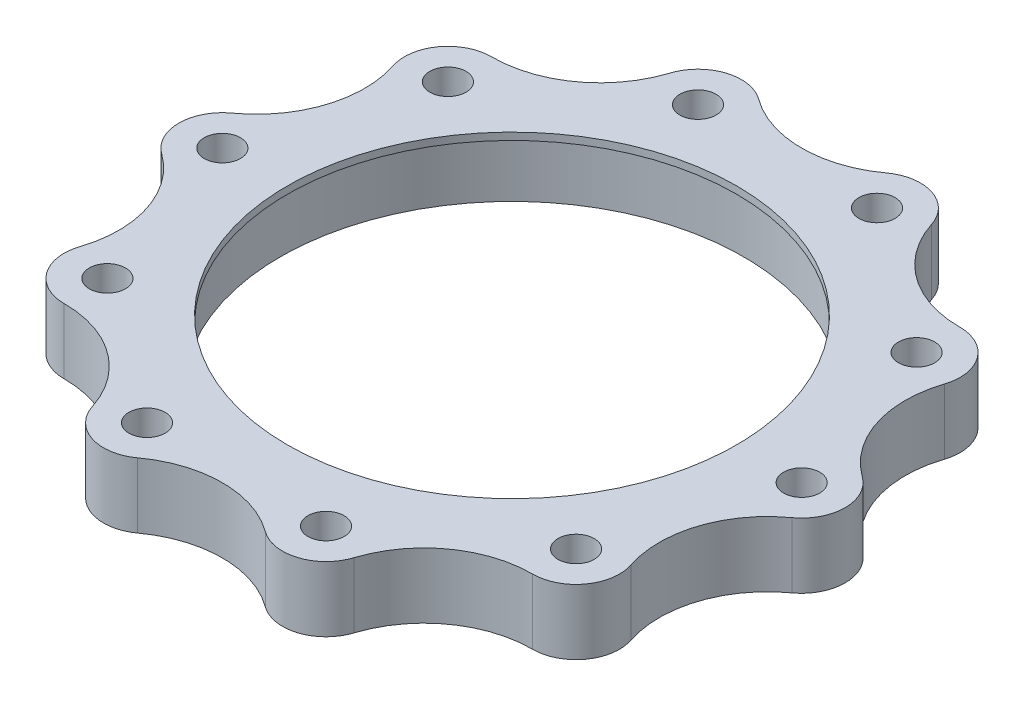
ISO-10303-21;
HEADER;
FILE_DESCRIPTION(('STEP AP214'),'2;1');
FILE_NAME('part.step','',(''),(''),'','','');
FILE_SCHEMA(('AUTOMOTIVE_DESIGN { 1 0 10303 214 1 1 1 1 }'));
ENDSEC;
DATA;
#1=APPLICATION_CONTEXT('core data for automotive mechanical design processes');
#2=APPLICATION_PROTOCOL_DEFINITION('international standard','automotive_design',2000,#1);
#3=PRODUCT_CONTEXT('',#1,'mechanical');
#4=PRODUCT('Part','Part','',(#3));
#5=PRODUCT_RELATED_PRODUCT_CATEGORY('part','',(#4));
#6=PRODUCT_DEFINITION_FORMATION('','',#4);
#7=PRODUCT_DEFINITION_CONTEXT('part definition',#1,'design');
#8=PRODUCT_DEFINITION('design','',#6,#7);
#9=PRODUCT_DEFINITION_SHAPE('','',#8);
#10=(LENGTH_UNIT() NAMED_UNIT(*) SI_UNIT(.MILLI.,.METRE.));
#11=(NAMED_UNIT(*) PLANE_ANGLE_UNIT() SI_UNIT($,.RADIAN.));
#12=(NAMED_UNIT(*) SI_UNIT($,.STERADIAN.) SOLID_ANGLE_UNIT());
#13=UNCERTAINTY_MEASURE_WITH_UNIT(LENGTH_MEASURE(1.E-05),#10,'distance_accuracy_value','');
#14=(GEOMETRIC_REPRESENTATION_CONTEXT(3) GLOBAL_UNCERTAINTY_ASSIGNED_CONTEXT((#13)) GLOBAL_UNIT_ASSIGNED_CONTEXT((#10,
#11,#12)) REPRESENTATION_CONTEXT('',''));
#15=CARTESIAN_POINT('',(0.,0.,0.));
#16=DIRECTION('',(0.,0.,1.));
#17=DIRECTION('',(1.,0.,0.));
#18=AXIS2_PLACEMENT_3D('',#15,#16,#17);
#19=CARTESIAN_POINT('',(0.,4.5,0.));
#20=DIRECTION('',(0.,-1.,0.));
#21=DIRECTION('',(0.,0.,-1.));
#22=AXIS2_PLACEMENT_3D('',#19,#20,#21);
#23=CYLINDRICAL_SURFACE('',#22,16.);
#24=CARTESIAN_POINT('',(0.,0.,0.));
#25=DIRECTION('',(0.,1.,0.));
#26=DIRECTION('',(0.,0.,1.));
#27=AXIS2_PLACEMENT_3D('',#24,#25,#26);
#28=CIRCLE('',#27,16.);
#29=CARTESIAN_POINT('',(0.,0.,16.));
#30=VERTEX_POINT('',#29);
#31=EDGE_CURVE('E627',#30,#30,#28,.T.);
#32=ORIENTED_EDGE('',*,*,#31,.F.);
#33=EDGE_LOOP('',(#32));
#34=FACE_BOUND('',#33,.T.);
#35=CARTESIAN_POINT('',(0.,4.,0.));
#36=DIRECTION('',(0.,1.,0.));
#37=DIRECTION('',(0.,0.,1.));
#38=AXIS2_PLACEMENT_3D('',#35,#36,#37);
#39=CIRCLE('',#38,16.);
#40=CARTESIAN_POINT('',(0.,4.,16.));
#41=VERTEX_POINT('',#40);
#42=EDGE_CURVE('E588',#41,#41,#39,.T.);
#43=ORIENTED_EDGE('',*,*,#42,.T.);
#44=EDGE_LOOP('',(#43));
#45=FACE_BOUND('',#44,.T.);
#46=ADVANCED_FACE('F35',(#34,#45),#23,.F.);
#47=CARTESIAN_POINT('',(23.0579497961856,4.5,-4.24278508120116));
#48=DIRECTION('',(0.,1.,0.));
#49=DIRECTION('',(0.,0.,1.));
#50=AXIS2_PLACEMENT_3D('',#47,#48,#49);
#51=PLANE('',#50);
#52=CARTESIAN_POINT('',(6.18033988749916,4.5,-19.021130325903));
#53=DIRECTION('',(0.,1.,0.));
#54=DIRECTION('',(0.,0.,1.));
#55=AXIS2_PLACEMENT_3D('',#52,#53,#54);
#56=CIRCLE('',#55,1.25);
#57=CARTESIAN_POINT('',(6.18033988749916,4.5,-17.771130325903));
#58=VERTEX_POINT('',#57);
#59=EDGE_CURVE('E600',#58,#58,#56,.T.);
#60=ORIENTED_EDGE('',*,*,#59,.F.);
#61=EDGE_LOOP('',(#60));
#62=FACE_BOUND('',#61,.T.);
#63=CARTESIAN_POINT('',(-16.1803398874988,4.5,-11.7557050458496));
#64=DIRECTION('',(0.,1.,0.));
#65=DIRECTION('',(0.,0.,1.));
#66=AXIS2_PLACEMENT_3D('',#63,#64,#65);
#67=CIRCLE('',#66,1.25);
#68=CARTESIAN_POINT('',(-16.1803398874988,4.5,-10.5057050458496));
#69=VERTEX_POINT('',#68);
#70=EDGE_CURVE('E612',#69,#69,#67,.T.);
#71=ORIENTED_EDGE('',*,*,#70,.F.);
#72=EDGE_LOOP('',(#71));
#73=FACE_BOUND('',#72,.T.);
#74=CARTESIAN_POINT('',(-16.180339887499,4.5,11.7557050458494));
#75=DIRECTION('',(0.,1.,0.));
#76=DIRECTION('',(0.,0.,1.));
#77=AXIS2_PLACEMENT_3D('',#74,#75,#76);
#78=CIRCLE('',#77,1.25);
#79=CARTESIAN_POINT('',(-16.180339887499,4.5,13.0057050458494));
#80=VERTEX_POINT('',#79);
#81=EDGE_CURVE('E624',#80,#80,#78,.T.);
#82=ORIENTED_EDGE('',*,*,#81,.F.);
#83=EDGE_LOOP('',(#82));
#84=FACE_BOUND('',#83,.T.);
#85=CARTESIAN_POINT('',(-6.18033988749903,4.5,19.021130325903));
#86=DIRECTION('',(0.,1.,0.));
#87=DIRECTION('',(0.,0.,1.));
#88=AXIS2_PLACEMENT_3D('',#85,#86,#87);
#89=CIRCLE('',#88,1.25);
#90=CARTESIAN_POINT('',(-6.18033988749903,4.5,20.271130325903));
#91=VERTEX_POINT('',#90);
#92=EDGE_CURVE('E633',#91,#91,#89,.T.);
#93=ORIENTED_EDGE('',*,*,#92,.F.);
#94=EDGE_LOOP('',(#93));
#95=FACE_BOUND('',#94,.T.);
#96=CARTESIAN_POINT('',(16.1803398874989,4.5,11.7557050458495));
#97=DIRECTION('',(0.,1.,0.));
#98=DIRECTION('',(0.,0.,1.));
#99=AXIS2_PLACEMENT_3D('',#96,#97,#98);
#100=CIRCLE('',#99,1.25);
#101=CARTESIAN_POINT('',(16.1803398874989,4.5,13.0057050458495));
#102=VERTEX_POINT('',#101);
#103=EDGE_CURVE('E645',#102,#102,#100,.T.);
#104=ORIENTED_EDGE('',*,*,#103,.F.);
#105=EDGE_LOOP('',(#104));
#106=FACE_BOUND('',#105,.T.);
#107=CARTESIAN_POINT('',(26.1158995923712,4.5,-8.48557016240232));
#108=DIRECTION('',(0.,-1.,0.));
#109=DIRECTION('',(0.,0.,1.));
#110=AXIS2_PLACEMENT_3D('',#107,#108,#109);
#111=CIRCLE('',#110,7.45988187337784);
#112=CARTESIAN_POINT('',(21.7541019104443,4.5,-2.43374741659354));
#113=VERTEX_POINT('',#112);
#114=CARTESIAN_POINT('',(19.0299589821927,4.5,-10.8177972597863));
#115=VERTEX_POINT('',#114);
#116=EDGE_CURVE('E244',#113,#115,#111,.T.);
#117=ORIENTED_EDGE('',*,*,#116,.T.);
#118=CARTESIAN_POINT('',(16.1803398874991,4.5,-11.7557050458493));
#119=DIRECTION('',(0.,1.,0.));
#120=DIRECTION('',(0.,0.,1.));
#121=AXIS2_PLACEMENT_3D('',#118,#119,#120);
#122=CIRCLE('',#121,3.);
#123=CARTESIAN_POINT('',(16.1689173036353,4.5,-14.755683299867));
#124=VERTEX_POINT('',#123);
#125=EDGE_CURVE('E131',#115,#124,#122,.T.);
#126=ORIENTED_EDGE('',*,*,#125,.T.);
#127=CARTESIAN_POINT('',(16.1405135948649,4.5,-22.2155110990912));
#128=DIRECTION('',(0.,-1.,0.));
#129=DIRECTION('',(0.,0.,1.));
#130=AXIS2_PLACEMENT_3D('',#127,#128,#129);
#131=CIRCLE('',#130,7.45988187337783);
#132=CARTESIAN_POINT('',(9.03701852725957,4.5,-19.9373110663334));
#133=VERTEX_POINT('',#132);
#134=EDGE_CURVE('E295',#124,#133,#131,.T.);
#135=ORIENTED_EDGE('',*,*,#134,.T.);
#136=CARTESIAN_POINT('',(6.18033988749894,4.5,-19.0211303259031));
#137=DIRECTION('',(0.,1.,0.));
#138=DIRECTION('',(0.,0.,1.));
#139=AXIS2_PLACEMENT_3D('',#136,#137,#138);
#140=CIRCLE('',#139,3.);
#141=CARTESIAN_POINT('',(4.407755848124,4.5,-21.4414496898204));
#142=VERTEX_POINT('',#141);
#143=EDGE_CURVE('E314',#133,#142,#140,.T.);
#144=ORIENTED_EDGE('',*,*,#143,.T.);
#145=CARTESIAN_POINT('',(0.,4.5,-27.4598818733778));
#146=DIRECTION('',(0.,-1.,0.));
#147=DIRECTION('',(0.,0.,1.));
#148=AXIS2_PLACEMENT_3D('',#145,#146,#147);
#149=CIRCLE('',#148,7.45988187337783);
#150=CARTESIAN_POINT('',(-4.40775584812401,4.5,-21.4414496898204));
#151=VERTEX_POINT('',#150);
#152=EDGE_CURVE('E311',#142,#151,#149,.T.);
#153=ORIENTED_EDGE('',*,*,#152,.T.);
#154=CARTESIAN_POINT('',(-6.18033988749895,4.5,-19.0211303259031));
#155=DIRECTION('',(0.,1.,0.));
#156=DIRECTION('',(0.,0.,1.));
#157=AXIS2_PLACEMENT_3D('',#154,#155,#156);
#158=CIRCLE('',#157,3.);
#159=CARTESIAN_POINT('',(-9.03701852725958,4.5,-19.9373110663333));
#160=VERTEX_POINT('',#159);
#161=EDGE_CURVE('E313',#151,#160,#158,.T.);
#162=ORIENTED_EDGE('',*,*,#161,.T.);
#163=CARTESIAN_POINT('',(-16.1405135948649,4.5,-22.2155110990912));
#164=DIRECTION('',(0.,-1.,0.));
#165=DIRECTION('',(0.,0.,1.));
#166=AXIS2_PLACEMENT_3D('',#163,#164,#165);
#167=CIRCLE('',#166,7.45988187337783);
#168=CARTESIAN_POINT('',(-16.1689173036353,4.5,-14.755683299867));
#169=VERTEX_POINT('',#168);
#170=EDGE_CURVE('E316',#160,#169,#167,.T.);
#171=ORIENTED_EDGE('',*,*,#170,.T.);
#172=CARTESIAN_POINT('',(-16.180339887499,4.5,-11.7557050458495));
#173=DIRECTION('',(0.,1.,0.));
#174=DIRECTION('',(0.,0.,1.));
#175=AXIS2_PLACEMENT_3D('',#172,#173,#174);
#176=CIRCLE('',#175,3.);
#177=CARTESIAN_POINT('',(-19.0299589821925,4.5,-10.8177972597864));
#178=VERTEX_POINT('',#177);
#179=EDGE_CURVE('E322',#169,#178,#176,.T.);
#180=ORIENTED_EDGE('',*,*,#179,.T.);
#181=CARTESIAN_POINT('',(-26.1158995923712,4.5,-8.48557016240231));
#182=DIRECTION('',(0.,-1.,0.));
#183=DIRECTION('',(0.,0.,1.));
#184=AXIS2_PLACEMENT_3D('',#181,#182,#183);
#185=CIRCLE('',#184,7.45988187337783);
#186=CARTESIAN_POINT('',(-21.7541019104443,4.5,-2.43374741659354));
#187=VERTEX_POINT('',#186);
#188=EDGE_CURVE('E324',#178,#187,#185,.T.);
#189=ORIENTED_EDGE('',*,*,#188,.T.);
#190=CARTESIAN_POINT('',(-20.,4.5,0.));
#191=DIRECTION('',(0.,1.,0.));
#192=DIRECTION('',(0.,0.,1.));
#193=AXIS2_PLACEMENT_3D('',#190,#191,#192);
#194=CIRCLE('',#193,2.99999999999999);
#195=CARTESIAN_POINT('',(-21.7541019104443,4.5,2.43374741659354));
#196=VERTEX_POINT('',#195);
#197=EDGE_CURVE('E326',#187,#196,#194,.T.);
#198=ORIENTED_EDGE('',*,*,#197,.T.);
#199=CARTESIAN_POINT('',(-26.1158995923712,4.5,8.48557016240233));
#200=DIRECTION('',(0.,-1.,0.));
#201=DIRECTION('',(0.,0.,1.));
#202=AXIS2_PLACEMENT_3D('',#199,#200,#201);
#203=CIRCLE('',#202,7.45988187337784);
#204=CARTESIAN_POINT('',(-19.0299589821925,4.5,10.8177972597863));
#205=VERTEX_POINT('',#204);
#206=EDGE_CURVE('E328',#196,#205,#203,.T.);
#207=ORIENTED_EDGE('',*,*,#206,.T.);
#208=CARTESIAN_POINT('',(-16.1803398874989,4.5,11.7557050458495));
#209=DIRECTION('',(0.,1.,0.));
#210=DIRECTION('',(0.,0.,1.));
#211=AXIS2_PLACEMENT_3D('',#208,#209,#210);
#212=CIRCLE('',#211,3.);
#213=CARTESIAN_POINT('',(-16.1689173036353,4.5,14.755683299867));
#214=VERTEX_POINT('',#213);
#215=EDGE_CURVE('E330',#205,#214,#212,.T.);
#216=ORIENTED_EDGE('',*,*,#215,.T.);
#217=CARTESIAN_POINT('',(-16.1405135948649,4.5,22.2155110990912));
#218=DIRECTION('',(0.,-1.,0.));
#219=DIRECTION('',(0.,0.,1.));
#220=AXIS2_PLACEMENT_3D('',#217,#218,#219);
#221=CIRCLE('',#220,7.45988187337783);
#222=CARTESIAN_POINT('',(-9.03701852725957,4.5,19.9373110663333));
#223=VERTEX_POINT('',#222);
#224=EDGE_CURVE('E332',#214,#223,#221,.T.);
#225=ORIENTED_EDGE('',*,*,#224,.T.);
#226=CARTESIAN_POINT('',(-6.18033988749895,4.5,19.0211303259031));
#227=DIRECTION('',(0.,1.,0.));
#228=DIRECTION('',(0.,0.,1.));
#229=AXIS2_PLACEMENT_3D('',#226,#227,#228);
#230=CIRCLE('',#229,3.);
#231=CARTESIAN_POINT('',(-4.407755848124,4.5,21.4414496898204));
#232=VERTEX_POINT('',#231);
#233=EDGE_CURVE('E334',#223,#232,#230,.T.);
#234=ORIENTED_EDGE('',*,*,#233,.T.);
#235=CARTESIAN_POINT('',(0.,4.5,27.4598818733778));
#236=DIRECTION('',(0.,-1.,0.));
#237=DIRECTION('',(0.,0.,1.));
#238=AXIS2_PLACEMENT_3D('',#235,#236,#237);
#239=CIRCLE('',#238,7.45988187337783);
#240=CARTESIAN_POINT('',(4.407755848124,4.5,21.4414496898204));
#241=VERTEX_POINT('',#240);
#242=EDGE_CURVE('E336',#232,#241,#239,.T.);
#243=ORIENTED_EDGE('',*,*,#242,.T.);
#244=CARTESIAN_POINT('',(6.18033988749895,4.5,19.0211303259031));
#245=DIRECTION('',(0.,1.,0.));
#246=DIRECTION('',(0.,0.,1.));
#247=AXIS2_PLACEMENT_3D('',#244,#245,#246);
#248=CIRCLE('',#247,3.);
#249=CARTESIAN_POINT('',(9.03701852725958,4.5,19.9373110663333));
#250=VERTEX_POINT('',#249);
#251=EDGE_CURVE('E338',#241,#250,#248,.T.);
#252=ORIENTED_EDGE('',*,*,#251,.T.);
#253=CARTESIAN_POINT('',(16.1405135948649,4.5,22.2155110990912));
#254=DIRECTION('',(0.,-1.,0.));
#255=DIRECTION('',(0.,0.,1.));
#256=AXIS2_PLACEMENT_3D('',#253,#254,#255);
#257=CIRCLE('',#256,7.45988187337783);
#258=CARTESIAN_POINT('',(16.1689173036353,4.5,14.755683299867));
#259=VERTEX_POINT('',#258);
#260=EDGE_CURVE('E187',#250,#259,#257,.T.);
#261=ORIENTED_EDGE('',*,*,#260,.T.);
#262=CARTESIAN_POINT('',(16.1803398874989,4.5,11.7557050458495));
#263=DIRECTION('',(0.,1.,0.));
#264=DIRECTION('',(0.,0.,1.));
#265=AXIS2_PLACEMENT_3D('',#262,#263,#264);
#266=CIRCLE('',#265,3.);
#267=CARTESIAN_POINT('',(19.0299589821925,4.5,10.8177972597864));
#268=VERTEX_POINT('',#267);
#269=EDGE_CURVE('E180',#259,#268,#266,.T.);
#270=ORIENTED_EDGE('',*,*,#269,.T.);
#271=CARTESIAN_POINT('',(26.1158995923712,4.5,8.48557016240231));
#272=DIRECTION('',(0.,-1.,0.));
#273=DIRECTION('',(0.,0.,1.));
#274=AXIS2_PLACEMENT_3D('',#271,#272,#273);
#275=CIRCLE('',#274,7.45988187337783);
#276=CARTESIAN_POINT('',(21.7541019104443,4.5,2.43374741659354));
#277=VERTEX_POINT('',#276);
#278=EDGE_CURVE('E185',#268,#277,#275,.T.);
#279=ORIENTED_EDGE('',*,*,#278,.T.);
#280=CARTESIAN_POINT('',(20.,4.5,0.));
#281=DIRECTION('',(0.,1.,0.));
#282=DIRECTION('',(0.,0.,1.));
#283=AXIS2_PLACEMENT_3D('',#280,#281,#282);
#284=CIRCLE('',#283,3.);
#285=EDGE_CURVE('E52',#277,#113,#284,.T.);
#286=ORIENTED_EDGE('',*,*,#285,.T.);
#287=EDGE_LOOP('',(#117,#126,#135,#144,#153,#162,#171,#180,#189,#198,#207,#216,#225,#234,#243,
#252,#261,#270,#279,#286));
#288=FACE_BOUND('',#287,.T.);
#289=CARTESIAN_POINT('',(20.,4.5,0.));
#290=DIRECTION('',(0.,1.,0.));
#291=DIRECTION('',(0.,0.,1.));
#292=AXIS2_PLACEMENT_3D('',#289,#290,#291);
#293=CIRCLE('',#292,1.25);
#294=CARTESIAN_POINT('',(20.,4.5,1.25));
#295=VERTEX_POINT('',#294);
#296=EDGE_CURVE('E209',#295,#295,#293,.T.);
#297=ORIENTED_EDGE('',*,*,#296,.F.);
#298=EDGE_LOOP('',(#297));
#299=FACE_BOUND('',#298,.T.);
#300=CARTESIAN_POINT('',(6.1803398874989,4.5,19.0211303259031));
#301=DIRECTION('',(0.,1.,0.));
#302=DIRECTION('',(0.,0.,1.));
#303=AXIS2_PLACEMENT_3D('',#300,#301,#302);
#304=CIRCLE('',#303,1.25);
#305=CARTESIAN_POINT('',(6.1803398874989,4.5,20.2711303259031));
#306=VERTEX_POINT('',#305);
#307=EDGE_CURVE('E639',#306,#306,#304,.T.);
#308=ORIENTED_EDGE('',*,*,#307,.F.);
#309=EDGE_LOOP('',(#308));
#310=FACE_BOUND('',#309,.T.);
#311=CARTESIAN_POINT('',(-20.,4.5,-1.39659253553725E-13));
#312=DIRECTION('',(0.,1.,0.));
#313=DIRECTION('',(0.,0.,1.));
#314=AXIS2_PLACEMENT_3D('',#311,#312,#313);
#315=CIRCLE('',#314,1.25);
#316=CARTESIAN_POINT('',(-20.,4.5,1.24999999999986));
#317=VERTEX_POINT('',#316);
#318=EDGE_CURVE('E618',#317,#317,#315,.T.);
#319=ORIENTED_EDGE('',*,*,#318,.F.);
#320=EDGE_LOOP('',(#319));
#321=FACE_BOUND('',#320,.T.);
#322=CARTESIAN_POINT('',(-6.18033988749876,4.5,-19.0211303259031));
#323=DIRECTION('',(0.,1.,0.));
#324=DIRECTION('',(0.,0.,1.));
#325=AXIS2_PLACEMENT_3D('',#322,#323,#324);
#326=CIRCLE('',#325,1.25);
#327=CARTESIAN_POINT('',(-6.18033988749876,4.5,-17.7711303259031));
#328=VERTEX_POINT('',#327);
#329=EDGE_CURVE('E606',#328,#328,#326,.T.);
#330=ORIENTED_EDGE('',*,*,#329,.F.);
#331=EDGE_LOOP('',(#330));
#332=FACE_BOUND('',#331,.T.);
#333=CARTESIAN_POINT('',(16.1803398874991,4.5,-11.7557050458493));
#334=DIRECTION('',(0.,1.,0.));
#335=DIRECTION('',(0.,0.,1.));
#336=AXIS2_PLACEMENT_3D('',#333,#334,#335);
#337=CIRCLE('',#336,1.25);
#338=CARTESIAN_POINT('',(16.1803398874991,4.5,-10.5057050458493));
#339=VERTEX_POINT('',#338);
#340=EDGE_CURVE('E594',#339,#339,#337,.T.);
#341=ORIENTED_EDGE('',*,*,#340,.F.);
#342=EDGE_LOOP('',(#341));
#343=FACE_BOUND('',#342,.T.);
#344=CARTESIAN_POINT('',(0.,4.5,0.));
#345=DIRECTION('',(0.,1.,0.));
#346=DIRECTION('',(0.,0.,1.));
#347=AXIS2_PLACEMENT_3D('',#344,#345,#346);
#348=CIRCLE('',#347,15.5);
#349=CARTESIAN_POINT('',(0.,4.5,15.5));
#350=VERTEX_POINT('',#349);
#351=EDGE_CURVE('E585',#350,#350,#348,.T.);
#352=ORIENTED_EDGE('',*,*,#351,.F.);
#353=EDGE_LOOP('',(#352));
#354=FACE_BOUND('',#353,.T.);
#355=ADVANCED_FACE('F182',(#62,#73,#84,#95,#106,#288,#299,#310,#321,#332,#343,#354),#51,.T.);
#356=CARTESIAN_POINT('',(23.0579497961856,0.,-4.24278508120116));
#357=DIRECTION('',(0.,1.,0.));
#358=DIRECTION('',(0.,0.,1.));
#359=AXIS2_PLACEMENT_3D('',#356,#357,#358);
#360=PLANE('',#359);
#361=CARTESIAN_POINT('',(26.1158995923712,0.,-8.48557016240232));
#362=DIRECTION('',(0.,-1.,0.));
#363=DIRECTION('',(0.,0.,1.));
#364=AXIS2_PLACEMENT_3D('',#361,#362,#363);
#365=CIRCLE('',#364,7.45988187337784);
#366=CARTESIAN_POINT('',(21.7541019104443,0.,-2.43374741659354));
#367=VERTEX_POINT('',#366);
#368=CARTESIAN_POINT('',(19.0299589821927,0.,-10.8177972597863));
#369=VERTEX_POINT('',#368);
#370=EDGE_CURVE('E205',#367,#369,#365,.T.);
#371=ORIENTED_EDGE('',*,*,#370,.F.);
#372=CARTESIAN_POINT('',(20.,0.,0.));
#373=DIRECTION('',(0.,1.,0.));
#374=DIRECTION('',(0.,0.,1.));
#375=AXIS2_PLACEMENT_3D('',#372,#373,#374);
#376=CIRCLE('',#375,3.);
#377=CARTESIAN_POINT('',(21.7541019104443,0.,2.43374741659354));
#378=VERTEX_POINT('',#377);
#379=EDGE_CURVE('E123',#378,#367,#376,.T.);
#380=ORIENTED_EDGE('',*,*,#379,.F.);
#381=CARTESIAN_POINT('',(26.1158995923712,0.,8.48557016240231));
#382=DIRECTION('',(0.,-1.,0.));
#383=DIRECTION('',(0.,0.,1.));
#384=AXIS2_PLACEMENT_3D('',#381,#382,#383);
#385=CIRCLE('',#384,7.45988187337783);
#386=CARTESIAN_POINT('',(19.0299589821925,0.,10.8177972597864));
#387=VERTEX_POINT('',#386);
#388=EDGE_CURVE('E117',#387,#378,#385,.T.);
#389=ORIENTED_EDGE('',*,*,#388,.F.);
#390=CARTESIAN_POINT('',(16.1803398874989,0.,11.7557050458495));
#391=DIRECTION('',(0.,1.,0.));
#392=DIRECTION('',(0.,0.,1.));
#393=AXIS2_PLACEMENT_3D('',#390,#391,#392);
#394=CIRCLE('',#393,3.);
#395=CARTESIAN_POINT('',(16.1689173036353,0.,14.755683299867));
#396=VERTEX_POINT('',#395);
#397=EDGE_CURVE('E195',#396,#387,#394,.T.);
#398=ORIENTED_EDGE('',*,*,#397,.F.);
#399=CARTESIAN_POINT('',(16.1405135948649,0.,22.2155110990912));
#400=DIRECTION('',(0.,-1.,0.));
#401=DIRECTION('',(0.,0.,1.));
#402=AXIS2_PLACEMENT_3D('',#399,#400,#401);
#403=CIRCLE('',#402,7.45988187337783);
#404=CARTESIAN_POINT('',(9.03701852725958,0.,19.9373110663333));
#405=VERTEX_POINT('',#404);
#406=EDGE_CURVE('E239',#405,#396,#403,.T.);
#407=ORIENTED_EDGE('',*,*,#406,.F.);
#408=CARTESIAN_POINT('',(6.18033988749895,0.,19.0211303259031));
#409=DIRECTION('',(0.,1.,0.));
#410=DIRECTION('',(0.,0.,1.));
#411=AXIS2_PLACEMENT_3D('',#408,#409,#410);
#412=CIRCLE('',#411,3.);
#413=CARTESIAN_POINT('',(4.407755848124,0.,21.4414496898204));
#414=VERTEX_POINT('',#413);
#415=EDGE_CURVE('E237',#414,#405,#412,.T.);
#416=ORIENTED_EDGE('',*,*,#415,.F.);
#417=CARTESIAN_POINT('',(0.,0.,27.4598818733778));
#418=DIRECTION('',(0.,-1.,0.));
#419=DIRECTION('',(0.,0.,1.));
#420=AXIS2_PLACEMENT_3D('',#417,#418,#419);
#421=CIRCLE('',#420,7.45988187337783);
#422=CARTESIAN_POINT('',(-4.407755848124,0.,21.4414496898204));
#423=VERTEX_POINT('',#422);
#424=EDGE_CURVE('E235',#423,#414,#421,.T.);
#425=ORIENTED_EDGE('',*,*,#424,.F.);
#426=CARTESIAN_POINT('',(-6.18033988749895,0.,19.0211303259031));
#427=DIRECTION('',(0.,1.,0.));
#428=DIRECTION('',(0.,0.,1.));
#429=AXIS2_PLACEMENT_3D('',#426,#427,#428);
#430=CIRCLE('',#429,3.);
#431=CARTESIAN_POINT('',(-9.03701852725957,0.,19.9373110663333));
#432=VERTEX_POINT('',#431);
#433=EDGE_CURVE('E233',#432,#423,#430,.T.);
#434=ORIENTED_EDGE('',*,*,#433,.F.);
#435=CARTESIAN_POINT('',(-16.1405135948649,0.,22.2155110990912));
#436=DIRECTION('',(0.,-1.,0.));
#437=DIRECTION('',(0.,0.,1.));
#438=AXIS2_PLACEMENT_3D('',#435,#436,#437);
#439=CIRCLE('',#438,7.45988187337783);
#440=CARTESIAN_POINT('',(-16.1689173036353,0.,14.755683299867));
#441=VERTEX_POINT('',#440);
#442=EDGE_CURVE('E231',#441,#432,#439,.T.);
#443=ORIENTED_EDGE('',*,*,#442,.F.);
#444=CARTESIAN_POINT('',(-16.1803398874989,0.,11.7557050458495));
#445=DIRECTION('',(0.,1.,0.));
#446=DIRECTION('',(0.,0.,1.));
#447=AXIS2_PLACEMENT_3D('',#444,#445,#446);
#448=CIRCLE('',#447,3.);
#449=CARTESIAN_POINT('',(-19.0299589821925,0.,10.8177972597863));
#450=VERTEX_POINT('',#449);
#451=EDGE_CURVE('E229',#450,#441,#448,.T.);
#452=ORIENTED_EDGE('',*,*,#451,.F.);
#453=CARTESIAN_POINT('',(-26.1158995923712,0.,8.48557016240233));
#454=DIRECTION('',(0.,-1.,0.));
#455=DIRECTION('',(0.,0.,1.));
#456=AXIS2_PLACEMENT_3D('',#453,#454,#455);
#457=CIRCLE('',#456,7.45988187337784);
#458=CARTESIAN_POINT('',(-21.7541019104443,0.,2.43374741659354));
#459=VERTEX_POINT('',#458);
#460=EDGE_CURVE('E227',#459,#450,#457,.T.);
#461=ORIENTED_EDGE('',*,*,#460,.F.);
#462=CARTESIAN_POINT('',(-20.,0.,0.));
#463=DIRECTION('',(0.,1.,0.));
#464=DIRECTION('',(0.,0.,1.));
#465=AXIS2_PLACEMENT_3D('',#462,#463,#464);
#466=CIRCLE('',#465,2.99999999999999);
#467=CARTESIAN_POINT('',(-21.7541019104443,0.,-2.43374741659354));
#468=VERTEX_POINT('',#467);
#469=EDGE_CURVE('E225',#468,#459,#466,.T.);
#470=ORIENTED_EDGE('',*,*,#469,.F.);
#471=CARTESIAN_POINT('',(-26.1158995923712,0.,-8.48557016240231));
#472=DIRECTION('',(0.,-1.,0.));
#473=DIRECTION('',(0.,0.,1.));
#474=AXIS2_PLACEMENT_3D('',#471,#472,#473);
#475=CIRCLE('',#474,7.45988187337783);
#476=CARTESIAN_POINT('',(-19.0299589821925,0.,-10.8177972597864));
#477=VERTEX_POINT('',#476);
#478=EDGE_CURVE('E223',#477,#468,#475,.T.);
#479=ORIENTED_EDGE('',*,*,#478,.F.);
#480=CARTESIAN_POINT('',(-16.180339887499,0.,-11.7557050458495));
#481=DIRECTION('',(0.,1.,0.));
#482=DIRECTION('',(0.,0.,1.));
#483=AXIS2_PLACEMENT_3D('',#480,#481,#482);
#484=CIRCLE('',#483,3.);
#485=CARTESIAN_POINT('',(-16.1689173036353,0.,-14.755683299867));
#486=VERTEX_POINT('',#485);
#487=EDGE_CURVE('E221',#486,#477,#484,.T.);
#488=ORIENTED_EDGE('',*,*,#487,.F.);
#489=CARTESIAN_POINT('',(-16.1405135948649,0.,-22.2155110990912));
#490=DIRECTION('',(0.,-1.,0.));
#491=DIRECTION('',(0.,0.,1.));
#492=AXIS2_PLACEMENT_3D('',#489,#490,#491);
#493=CIRCLE('',#492,7.45988187337783);
#494=CARTESIAN_POINT('',(-9.03701852725958,0.,-19.9373110663333));
#495=VERTEX_POINT('',#494);
#496=EDGE_CURVE('E219',#495,#486,#493,.T.);
#497=ORIENTED_EDGE('',*,*,#496,.F.);
#498=CARTESIAN_POINT('',(-6.18033988749895,0.,-19.0211303259031));
#499=DIRECTION('',(0.,1.,0.));
#500=DIRECTION('',(0.,0.,1.));
#501=AXIS2_PLACEMENT_3D('',#498,#499,#500);
#502=CIRCLE('',#501,3.);
#503=CARTESIAN_POINT('',(-4.40775584812401,0.,-21.4414496898204));
#504=VERTEX_POINT('',#503);
#505=EDGE_CURVE('E217',#504,#495,#502,.T.);
#506=ORIENTED_EDGE('',*,*,#505,.F.);
#507=CARTESIAN_POINT('',(0.,0.,-27.4598818733778));
#508=DIRECTION('',(0.,-1.,0.));
#509=DIRECTION('',(0.,0.,1.));
#510=AXIS2_PLACEMENT_3D('',#507,#508,#509);
#511=CIRCLE('',#510,7.45988187337783);
#512=CARTESIAN_POINT('',(4.407755848124,0.,-21.4414496898204));
#513=VERTEX_POINT('',#512);
#514=EDGE_CURVE('E215',#513,#504,#511,.T.);
#515=ORIENTED_EDGE('',*,*,#514,.F.);
#516=CARTESIAN_POINT('',(6.18033988749894,0.,-19.0211303259031));
#517=DIRECTION('',(0.,1.,0.));
#518=DIRECTION('',(0.,0.,1.));
#519=AXIS2_PLACEMENT_3D('',#516,#517,#518);
#520=CIRCLE('',#519,3.);
#521=CARTESIAN_POINT('',(9.03701852725957,0.,-19.9373110663334));
#522=VERTEX_POINT('',#521);
#523=EDGE_CURVE('E213',#522,#513,#520,.T.);
#524=ORIENTED_EDGE('',*,*,#523,.F.);
#525=CARTESIAN_POINT('',(16.1405135948649,0.,-22.2155110990912));
#526=DIRECTION('',(0.,-1.,0.));
#527=DIRECTION('',(0.,0.,1.));
#528=AXIS2_PLACEMENT_3D('',#525,#526,#527);
#529=CIRCLE('',#528,7.45988187337783);
#530=CARTESIAN_POINT('',(16.1689173036353,0.,-14.755683299867));
#531=VERTEX_POINT('',#530);
#532=EDGE_CURVE('E211',#531,#522,#529,.T.);
#533=ORIENTED_EDGE('',*,*,#532,.F.);
#534=CARTESIAN_POINT('',(16.1803398874991,0.,-11.7557050458493));
#535=DIRECTION('',(0.,1.,0.));
#536=DIRECTION('',(0.,0.,1.));
#537=AXIS2_PLACEMENT_3D('',#534,#535,#536);
#538=CIRCLE('',#537,3.);
#539=EDGE_CURVE('E208',#369,#531,#538,.T.);
#540=ORIENTED_EDGE('',*,*,#539,.F.);
#541=EDGE_LOOP('',(#371,#380,#389,#398,#407,#416,#425,#434,#443,#452,#461,#470,#479,#488,#497,
#506,#515,#524,#533,#540));
#542=FACE_BOUND('',#541,.T.);
#543=CARTESIAN_POINT('',(20.,0.,0.));
#544=DIRECTION('',(0.,1.,0.));
#545=DIRECTION('',(0.,0.,1.));
#546=AXIS2_PLACEMENT_3D('',#543,#544,#545);
#547=CIRCLE('',#546,1.25);
#548=CARTESIAN_POINT('',(20.,0.,1.25));
#549=VERTEX_POINT('',#548);
#550=EDGE_CURVE('E648',#549,#549,#547,.T.);
#551=ORIENTED_EDGE('',*,*,#550,.T.);
#552=EDGE_LOOP('',(#551));
#553=FACE_BOUND('',#552,.T.);
#554=CARTESIAN_POINT('',(16.1803398874989,0.,11.7557050458495));
#555=DIRECTION('',(0.,1.,0.));
#556=DIRECTION('',(0.,0.,1.));
#557=AXIS2_PLACEMENT_3D('',#554,#555,#556);
#558=CIRCLE('',#557,1.25);
#559=CARTESIAN_POINT('',(16.1803398874989,0.,13.0057050458495));
#560=VERTEX_POINT('',#559);
#561=EDGE_CURVE('E642',#560,#560,#558,.T.);
#562=ORIENTED_EDGE('',*,*,#561,.T.);
#563=EDGE_LOOP('',(#562));
#564=FACE_BOUND('',#563,.T.);
#565=CARTESIAN_POINT('',(6.1803398874989,0.,19.0211303259031));
#566=DIRECTION('',(0.,1.,0.));
#567=DIRECTION('',(0.,0.,1.));
#568=AXIS2_PLACEMENT_3D('',#565,#566,#567);
#569=CIRCLE('',#568,1.25);
#570=CARTESIAN_POINT('',(6.1803398874989,0.,20.2711303259031));
#571=VERTEX_POINT('',#570);
#572=EDGE_CURVE('E636',#571,#571,#569,.T.);
#573=ORIENTED_EDGE('',*,*,#572,.T.);
#574=EDGE_LOOP('',(#573));
#575=FACE_BOUND('',#574,.T.);
#576=CARTESIAN_POINT('',(-6.18033988749903,0.,19.021130325903));
#577=DIRECTION('',(0.,1.,0.));
#578=DIRECTION('',(0.,0.,1.));
#579=AXIS2_PLACEMENT_3D('',#576,#577,#578);
#580=CIRCLE('',#579,1.25);
#581=CARTESIAN_POINT('',(-6.18033988749903,0.,20.271130325903));
#582=VERTEX_POINT('',#581);
#583=EDGE_CURVE('E632',#582,#582,#580,.T.);
#584=ORIENTED_EDGE('',*,*,#583,.T.);
#585=EDGE_LOOP('',(#584));
#586=FACE_BOUND('',#585,.T.);
#587=ORIENTED_EDGE('',*,*,#31,.T.);
#588=EDGE_LOOP('',(#587));
#589=FACE_BOUND('',#588,.T.);
#590=CARTESIAN_POINT('',(-16.180339887499,0.,11.7557050458494));
#591=DIRECTION('',(0.,1.,0.));
#592=DIRECTION('',(0.,0.,1.));
#593=AXIS2_PLACEMENT_3D('',#590,#591,#592);
#594=CIRCLE('',#593,1.25);
#595=CARTESIAN_POINT('',(-16.180339887499,0.,13.0057050458494));
#596=VERTEX_POINT('',#595);
#597=EDGE_CURVE('E621',#596,#596,#594,.T.);
#598=ORIENTED_EDGE('',*,*,#597,.T.);
#599=EDGE_LOOP('',(#598));
#600=FACE_BOUND('',#599,.T.);
#601=CARTESIAN_POINT('',(-20.,0.,-1.39659253553725E-13));
#602=DIRECTION('',(0.,1.,0.));
#603=DIRECTION('',(0.,0.,1.));
#604=AXIS2_PLACEMENT_3D('',#601,#602,#603);
#605=CIRCLE('',#604,1.25);
#606=CARTESIAN_POINT('',(-20.,0.,1.24999999999986));
#607=VERTEX_POINT('',#606);
#608=EDGE_CURVE('E615',#607,#607,#605,.T.);
#609=ORIENTED_EDGE('',*,*,#608,.T.);
#610=EDGE_LOOP('',(#609));
#611=FACE_BOUND('',#610,.T.);
#612=CARTESIAN_POINT('',(-16.1803398874988,0.,-11.7557050458496));
#613=DIRECTION('',(0.,1.,0.));
#614=DIRECTION('',(0.,0.,1.));
#615=AXIS2_PLACEMENT_3D('',#612,#613,#614);
#616=CIRCLE('',#615,1.25);
#617=CARTESIAN_POINT('',(-16.1803398874988,0.,-10.5057050458496));
#618=VERTEX_POINT('',#617);
#619=EDGE_CURVE('E609',#618,#618,#616,.T.);
#620=ORIENTED_EDGE('',*,*,#619,.T.);
#621=EDGE_LOOP('',(#620));
#622=FACE_BOUND('',#621,.T.);
#623=CARTESIAN_POINT('',(-6.18033988749876,0.,-19.0211303259031));
#624=DIRECTION('',(0.,1.,0.));
#625=DIRECTION('',(0.,0.,1.));
#626=AXIS2_PLACEMENT_3D('',#623,#624,#625);
#627=CIRCLE('',#626,1.25);
#628=CARTESIAN_POINT('',(-6.18033988749876,0.,-17.7711303259031));
#629=VERTEX_POINT('',#628);
#630=EDGE_CURVE('E603',#629,#629,#627,.T.);
#631=ORIENTED_EDGE('',*,*,#630,.T.);
#632=EDGE_LOOP('',(#631));
#633=FACE_BOUND('',#632,.T.);
#634=CARTESIAN_POINT('',(6.18033988749916,0.,-19.021130325903));
#635=DIRECTION('',(0.,1.,0.));
#636=DIRECTION('',(0.,0.,1.));
#637=AXIS2_PLACEMENT_3D('',#634,#635,#636);
#638=CIRCLE('',#637,1.25);
#639=CARTESIAN_POINT('',(6.18033988749916,0.,-17.771130325903));
#640=VERTEX_POINT('',#639);
#641=EDGE_CURVE('E597',#640,#640,#638,.T.);
#642=ORIENTED_EDGE('',*,*,#641,.T.);
#643=EDGE_LOOP('',(#642));
#644=FACE_BOUND('',#643,.T.);
#645=CARTESIAN_POINT('',(16.1803398874991,0.,-11.7557050458493));
#646=DIRECTION('',(0.,1.,0.));
#647=DIRECTION('',(0.,0.,1.));
#648=AXIS2_PLACEMENT_3D('',#645,#646,#647);
#649=CIRCLE('',#648,1.25);
#650=CARTESIAN_POINT('',(16.1803398874991,0.,-10.5057050458493));
#651=VERTEX_POINT('',#650);
#652=EDGE_CURVE('E593',#651,#651,#649,.T.);
#653=ORIENTED_EDGE('',*,*,#652,.T.);
#654=EDGE_LOOP('',(#653));
#655=FACE_BOUND('',#654,.T.);
#656=ADVANCED_FACE('F299',(#542,#553,#564,#575,#586,#589,#600,#611,#622,#633,#644,#655),#360,.F.);
#657=CARTESIAN_POINT('',(26.1158995923712,4.5,-8.48557016240232));
#658=DIRECTION('',(0.,-1.,0.));
#659=DIRECTION('',(0.,0.,-1.));
#660=AXIS2_PLACEMENT_3D('',#657,#658,#659);
#661=CYLINDRICAL_SURFACE('',#660,7.45988187337784);
#662=ORIENTED_EDGE('',*,*,#370,.T.);
#663=DIRECTION('',(0.,-1.,0.));
#664=VECTOR('',#663,1.);
#665=CARTESIAN_POINT('',(19.0299589821927,4.5,-10.8177972597863));
#666=LINE('',#665,#664);
#667=EDGE_CURVE('E11',#115,#369,#666,.T.);
#668=ORIENTED_EDGE('',*,*,#667,.F.);
#669=ORIENTED_EDGE('',*,*,#116,.F.);
#670=DIRECTION('',(0.,-1.,0.));
#671=VECTOR('',#670,1.);
#672=CARTESIAN_POINT('',(21.7541019104443,4.5,-2.43374741659354));
#673=LINE('',#672,#671);
#674=EDGE_CURVE('E201',#113,#367,#673,.T.);
#675=ORIENTED_EDGE('',*,*,#674,.T.);
#676=EDGE_LOOP('',(#662,#668,#669,#675));
#677=FACE_BOUND('',#676,.T.);
#678=ADVANCED_FACE('F37',(#677),#661,.F.);
#679=CARTESIAN_POINT('',(16.1803398874991,4.5,-11.7557050458493));
#680=DIRECTION('',(0.,-1.,0.));
#681=DIRECTION('',(0.,0.,-1.));
#682=AXIS2_PLACEMENT_3D('',#679,#680,#681);
#683=CYLINDRICAL_SURFACE('',#682,3.);
#684=ORIENTED_EDGE('',*,*,#539,.T.);
#685=DIRECTION('',(0.,-1.,0.));
#686=VECTOR('',#685,1.);
#687=CARTESIAN_POINT('',(16.1689173036353,4.5,-14.755683299867));
#688=LINE('',#687,#686);
#689=EDGE_CURVE('E44',#124,#531,#688,.T.);
#690=ORIENTED_EDGE('',*,*,#689,.F.);
#691=ORIENTED_EDGE('',*,*,#125,.F.);
#692=ORIENTED_EDGE('',*,*,#667,.T.);
#693=EDGE_LOOP('',(#684,#690,#691,#692));
#694=FACE_BOUND('',#693,.T.);
#695=ADVANCED_FACE('F393',(#694),#683,.T.);
#696=CARTESIAN_POINT('',(16.1405135948649,4.5,-22.2155110990912));
#697=DIRECTION('',(0.,-1.,0.));
#698=DIRECTION('',(0.,0.,-1.));
#699=AXIS2_PLACEMENT_3D('',#696,#697,#698);
#700=CYLINDRICAL_SURFACE('',#699,7.45988187337783);
#701=ORIENTED_EDGE('',*,*,#532,.T.);
#702=DIRECTION('',(0.,-1.,0.));
#703=VECTOR('',#702,1.);
#704=CARTESIAN_POINT('',(9.03701852725957,4.5,-19.9373110663334));
#705=LINE('',#704,#703);
#706=EDGE_CURVE('E287',#133,#522,#705,.T.);
#707=ORIENTED_EDGE('',*,*,#706,.F.);
#708=ORIENTED_EDGE('',*,*,#134,.F.);
#709=ORIENTED_EDGE('',*,*,#689,.T.);
#710=EDGE_LOOP('',(#701,#707,#708,#709));
#711=FACE_BOUND('',#710,.T.);
#712=ADVANCED_FACE('F293',(#711),#700,.F.);
#713=CARTESIAN_POINT('',(6.18033988749894,4.5,-19.0211303259031));
#714=DIRECTION('',(0.,-1.,0.));
#715=DIRECTION('',(0.,0.,-1.));
#716=AXIS2_PLACEMENT_3D('',#713,#714,#715);
#717=CYLINDRICAL_SURFACE('',#716,3.);
#718=ORIENTED_EDGE('',*,*,#523,.T.);
#719=DIRECTION('',(0.,-1.,0.));
#720=VECTOR('',#719,1.);
#721=CARTESIAN_POINT('',(4.407755848124,4.5,-21.4414496898204));
#722=LINE('',#721,#720);
#723=EDGE_CURVE('E284',#142,#513,#722,.T.);
#724=ORIENTED_EDGE('',*,*,#723,.F.);
#725=ORIENTED_EDGE('',*,*,#143,.F.);
#726=ORIENTED_EDGE('',*,*,#706,.T.);
#727=EDGE_LOOP('',(#718,#724,#725,#726));
#728=FACE_BOUND('',#727,.T.);
#729=ADVANCED_FACE('F305',(#728),#717,.T.);
#730=CARTESIAN_POINT('',(0.,4.5,-27.4598818733778));
#731=DIRECTION('',(0.,-1.,0.));
#732=DIRECTION('',(0.,0.,-1.));
#733=AXIS2_PLACEMENT_3D('',#730,#731,#732);
#734=CYLINDRICAL_SURFACE('',#733,7.45988187337783);
#735=ORIENTED_EDGE('',*,*,#514,.T.);
#736=DIRECTION('',(0.,-1.,0.));
#737=VECTOR('',#736,1.);
#738=CARTESIAN_POINT('',(-4.40775584812401,4.5,-21.4414496898204));
#739=LINE('',#738,#737);
#740=EDGE_CURVE('E281',#151,#504,#739,.T.);
#741=ORIENTED_EDGE('',*,*,#740,.F.);
#742=ORIENTED_EDGE('',*,*,#152,.F.);
#743=ORIENTED_EDGE('',*,*,#723,.T.);
#744=EDGE_LOOP('',(#735,#741,#742,#743));
#745=FACE_BOUND('',#744,.T.);
#746=ADVANCED_FACE('F309',(#745),#734,.F.);
#747=CARTESIAN_POINT('',(-6.18033988749895,4.5,-19.0211303259031));
#748=DIRECTION('',(0.,-1.,0.));
#749=DIRECTION('',(0.,0.,-1.));
#750=AXIS2_PLACEMENT_3D('',#747,#748,#749);
#751=CYLINDRICAL_SURFACE('',#750,3.);
#752=ORIENTED_EDGE('',*,*,#505,.T.);
#753=DIRECTION('',(0.,-1.,0.));
#754=VECTOR('',#753,1.);
#755=CARTESIAN_POINT('',(-9.03701852725958,4.5,-19.9373110663333));
#756=LINE('',#755,#754);
#757=EDGE_CURVE('E278',#160,#495,#756,.T.);
#758=ORIENTED_EDGE('',*,*,#757,.F.);
#759=ORIENTED_EDGE('',*,*,#161,.F.);
#760=ORIENTED_EDGE('',*,*,#740,.T.);
#761=EDGE_LOOP('',(#752,#758,#759,#760));
#762=FACE_BOUND('',#761,.T.);
#763=ADVANCED_FACE('F406',(#762),#751,.T.);
#764=CARTESIAN_POINT('',(-16.1405135948649,4.5,-22.2155110990912));
#765=DIRECTION('',(0.,-1.,0.));
#766=DIRECTION('',(0.,0.,-1.));
#767=AXIS2_PLACEMENT_3D('',#764,#765,#766);
#768=CYLINDRICAL_SURFACE('',#767,7.45988187337783);
#769=ORIENTED_EDGE('',*,*,#496,.T.);
#770=DIRECTION('',(0.,-1.,0.));
#771=VECTOR('',#770,1.);
#772=CARTESIAN_POINT('',(-16.1689173036353,4.5,-14.755683299867));
#773=LINE('',#772,#771);
#774=EDGE_CURVE('E275',#169,#486,#773,.T.);
#775=ORIENTED_EDGE('',*,*,#774,.F.);
#776=ORIENTED_EDGE('',*,*,#170,.F.);
#777=ORIENTED_EDGE('',*,*,#757,.T.);
#778=EDGE_LOOP('',(#769,#775,#776,#777));
#779=FACE_BOUND('',#778,.T.);
#780=ADVANCED_FACE('F409',(#779),#768,.F.);
#781=CARTESIAN_POINT('',(-16.180339887499,4.5,-11.7557050458495));
#782=DIRECTION('',(0.,-1.,0.));
#783=DIRECTION('',(0.,0.,-1.));
#784=AXIS2_PLACEMENT_3D('',#781,#782,#783);
#785=CYLINDRICAL_SURFACE('',#784,3.);
#786=ORIENTED_EDGE('',*,*,#487,.T.);
#787=DIRECTION('',(0.,-1.,0.));
#788=VECTOR('',#787,1.);
#789=CARTESIAN_POINT('',(-19.0299589821925,4.5,-10.8177972597864));
#790=LINE('',#789,#788);
#791=EDGE_CURVE('E272',#178,#477,#790,.T.);
#792=ORIENTED_EDGE('',*,*,#791,.F.);
#793=ORIENTED_EDGE('',*,*,#179,.F.);
#794=ORIENTED_EDGE('',*,*,#774,.T.);
#795=EDGE_LOOP('',(#786,#792,#793,#794));
#796=FACE_BOUND('',#795,.T.);
#797=ADVANCED_FACE('F413',(#796),#785,.T.);
#798=CARTESIAN_POINT('',(-26.1158995923712,4.5,-8.48557016240231));
#799=DIRECTION('',(0.,-1.,0.));
#800=DIRECTION('',(0.,0.,-1.));
#801=AXIS2_PLACEMENT_3D('',#798,#799,#800);
#802=CYLINDRICAL_SURFACE('',#801,7.45988187337783);
#803=ORIENTED_EDGE('',*,*,#478,.T.);
#804=DIRECTION('',(0.,-1.,0.));
#805=VECTOR('',#804,1.);
#806=CARTESIAN_POINT('',(-21.7541019104443,4.5,-2.43374741659354));
#807=LINE('',#806,#805);
#808=EDGE_CURVE('E269',#187,#468,#807,.T.);
#809=ORIENTED_EDGE('',*,*,#808,.F.);
#810=ORIENTED_EDGE('',*,*,#188,.F.);
#811=ORIENTED_EDGE('',*,*,#791,.T.);
#812=EDGE_LOOP('',(#803,#809,#810,#811));
#813=FACE_BOUND('',#812,.T.);
#814=ADVANCED_FACE('F417',(#813),#802,.F.);
#815=CARTESIAN_POINT('',(-20.,4.5,0.));
#816=DIRECTION('',(0.,-1.,0.));
#817=DIRECTION('',(0.,0.,-1.));
#818=AXIS2_PLACEMENT_3D('',#815,#816,#817);
#819=CYLINDRICAL_SURFACE('',#818,2.99999999999999);
#820=ORIENTED_EDGE('',*,*,#469,.T.);
#821=DIRECTION('',(0.,-1.,0.));
#822=VECTOR('',#821,1.);
#823=CARTESIAN_POINT('',(-21.7541019104443,4.5,2.43374741659354));
#824=LINE('',#823,#822);
#825=EDGE_CURVE('E266',#196,#459,#824,.T.);
#826=ORIENTED_EDGE('',*,*,#825,.F.);
#827=ORIENTED_EDGE('',*,*,#197,.F.);
#828=ORIENTED_EDGE('',*,*,#808,.T.);
#829=EDGE_LOOP('',(#820,#826,#827,#828));
#830=FACE_BOUND('',#829,.T.);
#831=ADVANCED_FACE('F421',(#830),#819,.T.);
#832=CARTESIAN_POINT('',(-26.1158995923712,4.5,8.48557016240233));
#833=DIRECTION('',(0.,-1.,0.));
#834=DIRECTION('',(0.,0.,-1.));
#835=AXIS2_PLACEMENT_3D('',#832,#833,#834);
#836=CYLINDRICAL_SURFACE('',#835,7.45988187337784);
#837=ORIENTED_EDGE('',*,*,#460,.T.);
#838=DIRECTION('',(0.,-1.,0.));
#839=VECTOR('',#838,1.);
#840=CARTESIAN_POINT('',(-19.0299589821925,4.5,10.8177972597863));
#841=LINE('',#840,#839);
#842=EDGE_CURVE('E263',#205,#450,#841,.T.);
#843=ORIENTED_EDGE('',*,*,#842,.F.);
#844=ORIENTED_EDGE('',*,*,#206,.F.);
#845=ORIENTED_EDGE('',*,*,#825,.T.);
#846=EDGE_LOOP('',(#837,#843,#844,#845));
#847=FACE_BOUND('',#846,.T.);
#848=ADVANCED_FACE('F425',(#847),#836,.F.);
#849=CARTESIAN_POINT('',(-16.1803398874989,4.5,11.7557050458495));
#850=DIRECTION('',(0.,-1.,0.));
#851=DIRECTION('',(0.,0.,-1.));
#852=AXIS2_PLACEMENT_3D('',#849,#850,#851);
#853=CYLINDRICAL_SURFACE('',#852,3.);
#854=ORIENTED_EDGE('',*,*,#451,.T.);
#855=DIRECTION('',(0.,-1.,0.));
#856=VECTOR('',#855,1.);
#857=CARTESIAN_POINT('',(-16.1689173036353,4.5,14.755683299867));
#858=LINE('',#857,#856);
#859=EDGE_CURVE('E260',#214,#441,#858,.T.);
#860=ORIENTED_EDGE('',*,*,#859,.F.);
#861=ORIENTED_EDGE('',*,*,#215,.F.);
#862=ORIENTED_EDGE('',*,*,#842,.T.);
#863=EDGE_LOOP('',(#854,#860,#861,#862));
#864=FACE_BOUND('',#863,.T.);
#865=ADVANCED_FACE('F429',(#864),#853,.T.);
#866=CARTESIAN_POINT('',(-16.1405135948649,4.5,22.2155110990912));
#867=DIRECTION('',(0.,-1.,0.));
#868=DIRECTION('',(0.,0.,-1.));
#869=AXIS2_PLACEMENT_3D('',#866,#867,#868);
#870=CYLINDRICAL_SURFACE('',#869,7.45988187337783);
#871=ORIENTED_EDGE('',*,*,#442,.T.);
#872=DIRECTION('',(0.,-1.,0.));
#873=VECTOR('',#872,1.);
#874=CARTESIAN_POINT('',(-9.03701852725957,4.5,19.9373110663333));
#875=LINE('',#874,#873);
#876=EDGE_CURVE('E257',#223,#432,#875,.T.);
#877=ORIENTED_EDGE('',*,*,#876,.F.);
#878=ORIENTED_EDGE('',*,*,#224,.F.);
#879=ORIENTED_EDGE('',*,*,#859,.T.);
#880=EDGE_LOOP('',(#871,#877,#878,#879));
#881=FACE_BOUND('',#880,.T.);
#882=ADVANCED_FACE('F433',(#881),#870,.F.);
#883=CARTESIAN_POINT('',(-6.18033988749895,4.5,19.0211303259031));
#884=DIRECTION('',(0.,-1.,0.));
#885=DIRECTION('',(0.,0.,-1.));
#886=AXIS2_PLACEMENT_3D('',#883,#884,#885);
#887=CYLINDRICAL_SURFACE('',#886,3.);
#888=ORIENTED_EDGE('',*,*,#433,.T.);
#889=DIRECTION('',(0.,-1.,0.));
#890=VECTOR('',#889,1.);
#891=CARTESIAN_POINT('',(-4.407755848124,4.5,21.4414496898204));
#892=LINE('',#891,#890);
#893=EDGE_CURVE('E254',#232,#423,#892,.T.);
#894=ORIENTED_EDGE('',*,*,#893,.F.);
#895=ORIENTED_EDGE('',*,*,#233,.F.);
#896=ORIENTED_EDGE('',*,*,#876,.T.);
#897=EDGE_LOOP('',(#888,#894,#895,#896));
#898=FACE_BOUND('',#897,.T.);
#899=ADVANCED_FACE('F437',(#898),#887,.T.);
#900=CARTESIAN_POINT('',(0.,4.5,27.4598818733778));
#901=DIRECTION('',(0.,-1.,0.));
#902=DIRECTION('',(0.,0.,-1.));
#903=AXIS2_PLACEMENT_3D('',#900,#901,#902);
#904=CYLINDRICAL_SURFACE('',#903,7.45988187337783);
#905=ORIENTED_EDGE('',*,*,#424,.T.);
#906=DIRECTION('',(0.,-1.,0.));
#907=VECTOR('',#906,1.);
#908=CARTESIAN_POINT('',(4.407755848124,4.5,21.4414496898204));
#909=LINE('',#908,#907);
#910=EDGE_CURVE('E251',#241,#414,#909,.T.);
#911=ORIENTED_EDGE('',*,*,#910,.F.);
#912=ORIENTED_EDGE('',*,*,#242,.F.);
#913=ORIENTED_EDGE('',*,*,#893,.T.);
#914=EDGE_LOOP('',(#905,#911,#912,#913));
#915=FACE_BOUND('',#914,.T.);
#916=ADVANCED_FACE('F441',(#915),#904,.F.);
#917=CARTESIAN_POINT('',(6.18033988749895,4.5,19.0211303259031));
#918=DIRECTION('',(0.,-1.,0.));
#919=DIRECTION('',(0.,0.,-1.));
#920=AXIS2_PLACEMENT_3D('',#917,#918,#919);
#921=CYLINDRICAL_SURFACE('',#920,3.);
#922=ORIENTED_EDGE('',*,*,#415,.T.);
#923=DIRECTION('',(0.,-1.,0.));
#924=VECTOR('',#923,1.);
#925=CARTESIAN_POINT('',(9.03701852725958,4.5,19.9373110663333));
#926=LINE('',#925,#924);
#927=EDGE_CURVE('E248',#250,#405,#926,.T.);
#928=ORIENTED_EDGE('',*,*,#927,.F.);
#929=ORIENTED_EDGE('',*,*,#251,.F.);
#930=ORIENTED_EDGE('',*,*,#910,.T.);
#931=EDGE_LOOP('',(#922,#928,#929,#930));
#932=FACE_BOUND('',#931,.T.);
#933=ADVANCED_FACE('F344',(#932),#921,.T.);
#934=CARTESIAN_POINT('',(16.1405135948649,4.5,22.2155110990912));
#935=DIRECTION('',(0.,-1.,0.));
#936=DIRECTION('',(0.,0.,-1.));
#937=AXIS2_PLACEMENT_3D('',#934,#935,#936);
#938=CYLINDRICAL_SURFACE('',#937,7.45988187337783);
#939=ORIENTED_EDGE('',*,*,#406,.T.);
#940=DIRECTION('',(0.,-1.,0.));
#941=VECTOR('',#940,1.);
#942=CARTESIAN_POINT('',(16.1689173036353,4.5,14.755683299867));
#943=LINE('',#942,#941);
#944=EDGE_CURVE('E196',#259,#396,#943,.T.);
#945=ORIENTED_EDGE('',*,*,#944,.F.);
#946=ORIENTED_EDGE('',*,*,#260,.F.);
#947=ORIENTED_EDGE('',*,*,#927,.T.);
#948=EDGE_LOOP('',(#939,#945,#946,#947));
#949=FACE_BOUND('',#948,.T.);
#950=ADVANCED_FACE('F348',(#949),#938,.F.);
#951=CARTESIAN_POINT('',(16.1803398874989,4.5,11.7557050458495));
#952=DIRECTION('',(0.,-1.,0.));
#953=DIRECTION('',(0.,0.,-1.));
#954=AXIS2_PLACEMENT_3D('',#951,#952,#953);
#955=CYLINDRICAL_SURFACE('',#954,3.);
#956=ORIENTED_EDGE('',*,*,#397,.T.);
#957=DIRECTION('',(0.,-1.,0.));
#958=VECTOR('',#957,1.);
#959=CARTESIAN_POINT('',(19.0299589821925,4.5,10.8177972597864));
#960=LINE('',#959,#958);
#961=EDGE_CURVE('E192',#268,#387,#960,.T.);
#962=ORIENTED_EDGE('',*,*,#961,.F.);
#963=ORIENTED_EDGE('',*,*,#269,.F.);
#964=ORIENTED_EDGE('',*,*,#944,.T.);
#965=EDGE_LOOP('',(#956,#962,#963,#964));
#966=FACE_BOUND('',#965,.T.);
#967=ADVANCED_FACE('F193',(#966),#955,.T.);
#968=CARTESIAN_POINT('',(26.1158995923712,4.5,8.48557016240231));
#969=DIRECTION('',(0.,-1.,0.));
#970=DIRECTION('',(0.,0.,-1.));
#971=AXIS2_PLACEMENT_3D('',#968,#969,#970);
#972=CYLINDRICAL_SURFACE('',#971,7.45988187337783);
#973=ORIENTED_EDGE('',*,*,#388,.T.);
#974=DIRECTION('',(0.,-1.,0.));
#975=VECTOR('',#974,1.);
#976=CARTESIAN_POINT('',(21.7541019104443,4.5,2.43374741659354));
#977=LINE('',#976,#975);
#978=EDGE_CURVE('E197',#277,#378,#977,.T.);
#979=ORIENTED_EDGE('',*,*,#978,.F.);
#980=ORIENTED_EDGE('',*,*,#278,.F.);
#981=ORIENTED_EDGE('',*,*,#961,.T.);
#982=EDGE_LOOP('',(#973,#979,#980,#981));
#983=FACE_BOUND('',#982,.T.);
#984=ADVANCED_FACE('F199',(#983),#972,.F.);
#985=CARTESIAN_POINT('',(20.,4.5,0.));
#986=DIRECTION('',(0.,-1.,0.));
#987=DIRECTION('',(0.,0.,-1.));
#988=AXIS2_PLACEMENT_3D('',#985,#986,#987);
#989=CYLINDRICAL_SURFACE('',#988,3.);
#990=ORIENTED_EDGE('',*,*,#379,.T.);
#991=ORIENTED_EDGE('',*,*,#674,.F.);
#992=ORIENTED_EDGE('',*,*,#285,.F.);
#993=ORIENTED_EDGE('',*,*,#978,.T.);
#994=EDGE_LOOP('',(#990,#991,#992,#993));
#995=FACE_BOUND('',#994,.T.);
#996=ADVANCED_FACE('F352',(#995),#989,.T.);
#997=CARTESIAN_POINT('',(20.,4.5,0.));
#998=DIRECTION('',(0.,-1.,0.));
#999=DIRECTION('',(0.,0.,-1.));
#1000=AXIS2_PLACEMENT_3D('',#997,#998,#999);
#1001=CYLINDRICAL_SURFACE('',#1000,1.25);
#1002=ORIENTED_EDGE('',*,*,#296,.T.);
#1003=EDGE_LOOP('',(#1002));
#1004=FACE_BOUND('',#1003,.T.);
#1005=ORIENTED_EDGE('',*,*,#550,.F.);
#1006=EDGE_LOOP('',(#1005));
#1007=FACE_BOUND('',#1006,.T.);
#1008=ADVANCED_FACE('F354',(#1004,#1007),#1001,.F.);
#1009=CARTESIAN_POINT('',(16.1803398874989,4.5,11.7557050458495));
#1010=DIRECTION('',(0.,-1.,0.));
#1011=DIRECTION('',(0.,0.,-1.));
#1012=AXIS2_PLACEMENT_3D('',#1009,#1010,#1011);
#1013=CYLINDRICAL_SURFACE('',#1012,1.25);
#1014=ORIENTED_EDGE('',*,*,#103,.T.);
#1015=EDGE_LOOP('',(#1014));
#1016=FACE_BOUND('',#1015,.T.);
#1017=ORIENTED_EDGE('',*,*,#561,.F.);
#1018=EDGE_LOOP('',(#1017));
#1019=FACE_BOUND('',#1018,.T.);
#1020=ADVANCED_FACE('F360',(#1016,#1019),#1013,.F.);
#1021=CARTESIAN_POINT('',(6.1803398874989,4.5,19.0211303259031));
#1022=DIRECTION('',(0.,-1.,0.));
#1023=DIRECTION('',(0.,0.,-1.));
#1024=AXIS2_PLACEMENT_3D('',#1021,#1022,#1023);
#1025=CYLINDRICAL_SURFACE('',#1024,1.25);
#1026=ORIENTED_EDGE('',*,*,#307,.T.);
#1027=EDGE_LOOP('',(#1026));
#1028=FACE_BOUND('',#1027,.T.);
#1029=ORIENTED_EDGE('',*,*,#572,.F.);
#1030=EDGE_LOOP('',(#1029));
#1031=FACE_BOUND('',#1030,.T.);
#1032=ADVANCED_FACE('F382',(#1028,#1031),#1025,.F.);
#1033=CARTESIAN_POINT('',(-6.18033988749903,4.5,19.021130325903));
#1034=DIRECTION('',(0.,-1.,0.));
#1035=DIRECTION('',(0.,0.,-1.));
#1036=AXIS2_PLACEMENT_3D('',#1033,#1034,#1035);
#1037=CYLINDRICAL_SURFACE('',#1036,1.25);
#1038=ORIENTED_EDGE('',*,*,#92,.T.);
#1039=EDGE_LOOP('',(#1038));
#1040=FACE_BOUND('',#1039,.T.);
#1041=ORIENTED_EDGE('',*,*,#583,.F.);
#1042=EDGE_LOOP('',(#1041));
#1043=FACE_BOUND('',#1042,.T.);
#1044=ADVANCED_FACE('F379',(#1040,#1043),#1037,.F.);
#1045=CARTESIAN_POINT('',(-16.180339887499,4.5,11.7557050458494));
#1046=DIRECTION('',(0.,-1.,0.));
#1047=DIRECTION('',(0.,0.,-1.));
#1048=AXIS2_PLACEMENT_3D('',#1045,#1046,#1047);
#1049=CYLINDRICAL_SURFACE('',#1048,1.25);
#1050=ORIENTED_EDGE('',*,*,#81,.T.);
#1051=EDGE_LOOP('',(#1050));
#1052=FACE_BOUND('',#1051,.T.);
#1053=ORIENTED_EDGE('',*,*,#597,.F.);
#1054=EDGE_LOOP('',(#1053));
#1055=FACE_BOUND('',#1054,.T.);
#1056=ADVANCED_FACE('F377',(#1052,#1055),#1049,.F.);
#1057=CARTESIAN_POINT('',(-20.,4.5,-1.39659253553725E-13));
#1058=DIRECTION('',(0.,-1.,0.));
#1059=DIRECTION('',(0.,0.,-1.));
#1060=AXIS2_PLACEMENT_3D('',#1057,#1058,#1059);
#1061=CYLINDRICAL_SURFACE('',#1060,1.25);
#1062=ORIENTED_EDGE('',*,*,#318,.T.);
#1063=EDGE_LOOP('',(#1062));
#1064=FACE_BOUND('',#1063,.T.);
#1065=ORIENTED_EDGE('',*,*,#608,.F.);
#1066=EDGE_LOOP('',(#1065));
#1067=FACE_BOUND('',#1066,.T.);
#1068=ADVANCED_FACE('F496',(#1064,#1067),#1061,.F.);
#1069=CARTESIAN_POINT('',(-16.1803398874988,4.5,-11.7557050458496));
#1070=DIRECTION('',(0.,-1.,0.));
#1071=DIRECTION('',(0.,0.,-1.));
#1072=AXIS2_PLACEMENT_3D('',#1069,#1070,#1071);
#1073=CYLINDRICAL_SURFACE('',#1072,1.25);
#1074=ORIENTED_EDGE('',*,*,#70,.T.);
#1075=EDGE_LOOP('',(#1074));
#1076=FACE_BOUND('',#1075,.T.);
#1077=ORIENTED_EDGE('',*,*,#619,.F.);
#1078=EDGE_LOOP('',(#1077));
#1079=FACE_BOUND('',#1078,.T.);
#1080=ADVANCED_FACE('F505',(#1076,#1079),#1073,.F.);
#1081=CARTESIAN_POINT('',(-6.18033988749876,4.5,-19.0211303259031));
#1082=DIRECTION('',(0.,-1.,0.));
#1083=DIRECTION('',(0.,0.,-1.));
#1084=AXIS2_PLACEMENT_3D('',#1081,#1082,#1083);
#1085=CYLINDRICAL_SURFACE('',#1084,1.25);
#1086=ORIENTED_EDGE('',*,*,#329,.T.);
#1087=EDGE_LOOP('',(#1086));
#1088=FACE_BOUND('',#1087,.T.);
#1089=ORIENTED_EDGE('',*,*,#630,.F.);
#1090=EDGE_LOOP('',(#1089));
#1091=FACE_BOUND('',#1090,.T.);
#1092=ADVANCED_FACE('F514',(#1088,#1091),#1085,.F.);
#1093=CARTESIAN_POINT('',(6.18033988749916,4.5,-19.021130325903));
#1094=DIRECTION('',(0.,-1.,0.));
#1095=DIRECTION('',(0.,0.,-1.));
#1096=AXIS2_PLACEMENT_3D('',#1093,#1094,#1095);
#1097=CYLINDRICAL_SURFACE('',#1096,1.25);
#1098=ORIENTED_EDGE('',*,*,#59,.T.);
#1099=EDGE_LOOP('',(#1098));
#1100=FACE_BOUND('',#1099,.T.);
#1101=ORIENTED_EDGE('',*,*,#641,.F.);
#1102=EDGE_LOOP('',(#1101));
#1103=FACE_BOUND('',#1102,.T.);
#1104=ADVANCED_FACE('F524',(#1100,#1103),#1097,.F.);
#1105=CARTESIAN_POINT('',(16.1803398874991,4.5,-11.7557050458493));
#1106=DIRECTION('',(0.,-1.,0.));
#1107=DIRECTION('',(0.,0.,-1.));
#1108=AXIS2_PLACEMENT_3D('',#1105,#1106,#1107);
#1109=CYLINDRICAL_SURFACE('',#1108,1.25);
#1110=ORIENTED_EDGE('',*,*,#340,.T.);
#1111=EDGE_LOOP('',(#1110));
#1112=FACE_BOUND('',#1111,.T.);
#1113=ORIENTED_EDGE('',*,*,#652,.F.);
#1114=EDGE_LOOP('',(#1113));
#1115=FACE_BOUND('',#1114,.T.);
#1116=ADVANCED_FACE('F534',(#1112,#1115),#1109,.F.);
#1117=CARTESIAN_POINT('',(0.,4.,0.));
#1118=DIRECTION('',(0.,1.,0.));
#1119=DIRECTION('',(0.,0.,1.));
#1120=AXIS2_PLACEMENT_3D('',#1117,#1118,#1119);
#1121=PLANE('',#1120);
#1122=CARTESIAN_POINT('',(0.,4.,0.));
#1123=DIRECTION('',(0.,1.,0.));
#1124=DIRECTION('',(0.,0.,1.));
#1125=AXIS2_PLACEMENT_3D('',#1122,#1123,#1124);
#1126=CIRCLE('',#1125,15.5);
#1127=CARTESIAN_POINT('',(0.,4.,15.5));
#1128=VERTEX_POINT('',#1127);
#1129=EDGE_CURVE('E582',#1128,#1128,#1126,.T.);
#1130=ORIENTED_EDGE('',*,*,#1129,.T.);
#1131=EDGE_LOOP('',(#1130));
#1132=FACE_BOUND('',#1131,.T.);
#1133=ORIENTED_EDGE('',*,*,#42,.F.);
#1134=EDGE_LOOP('',(#1133));
#1135=FACE_BOUND('',#1134,.T.);
#1136=ADVANCED_FACE('F543',(#1132,#1135),#1121,.F.);
#1137=CARTESIAN_POINT('',(0.,4.,0.));
#1138=DIRECTION('',(0.,1.,0.));
#1139=DIRECTION('',(0.,0.,1.));
#1140=AXIS2_PLACEMENT_3D('',#1137,#1138,#1139);
#1141=CYLINDRICAL_SURFACE('',#1140,15.5);
#1142=ORIENTED_EDGE('',*,*,#1129,.F.);
#1143=EDGE_LOOP('',(#1142));
#1144=FACE_BOUND('',#1143,.T.);
#1145=ORIENTED_EDGE('',*,*,#351,.T.);
#1146=EDGE_LOOP('',(#1145));
#1147=FACE_BOUND('',#1146,.T.);
#1148=ADVANCED_FACE('F565',(#1144,#1147),#1141,.F.);
#1149=CLOSED_SHELL('',(#46,#355,#656,#678,#695,#712,#729,#746,#763,#780,#797,#814,#831,#848,
#865,#882,#899,#916,#933,#950,#967,#984,#996,#1008,#1020,#1032,#1044,#1056,#1068,#1080,#1092,
#1104,#1116,#1136,#1148));
#1150=MANIFOLD_SOLID_BREP('B2',#1149);
#1151=ADVANCED_BREP_SHAPE_REPRESENTATION('',(#18,#1150),#14);
#1152=SHAPE_DEFINITION_REPRESENTATION(#9,#1151);
ENDSEC;
END-ISO-10303-21;
